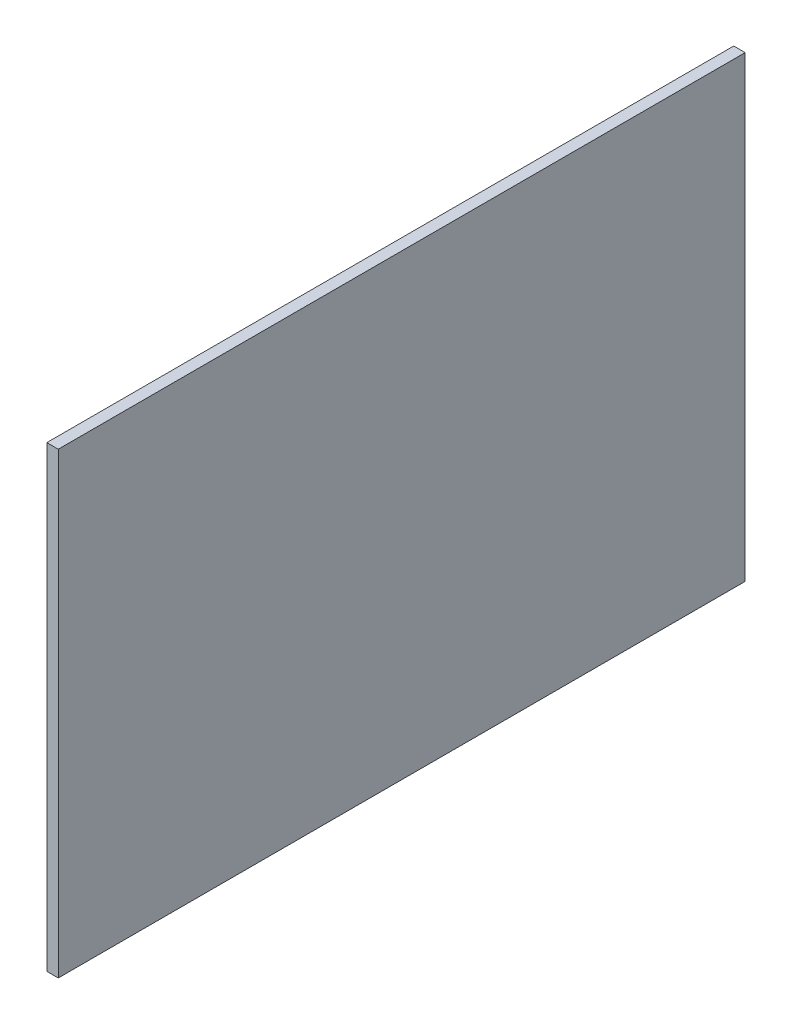
ISO-10303-21;
HEADER;
FILE_DESCRIPTION(('STEP AP214'),'2;1');
FILE_NAME('part.step','',(''),(''),'','','');
FILE_SCHEMA(('AUTOMOTIVE_DESIGN { 1 0 10303 214 1 1 1 1 }'));
ENDSEC;
DATA;
#1=APPLICATION_CONTEXT('core data for automotive mechanical design processes');
#2=APPLICATION_PROTOCOL_DEFINITION('international standard','automotive_design',2000,#1);
#3=PRODUCT_CONTEXT('',#1,'mechanical');
#4=PRODUCT('Part','Part','',(#3));
#5=PRODUCT_RELATED_PRODUCT_CATEGORY('part','',(#4));
#6=PRODUCT_DEFINITION_FORMATION('','',#4);
#7=PRODUCT_DEFINITION_CONTEXT('part definition',#1,'design');
#8=PRODUCT_DEFINITION('design','',#6,#7);
#9=PRODUCT_DEFINITION_SHAPE('','',#8);
#10=(LENGTH_UNIT() NAMED_UNIT(*) SI_UNIT(.MILLI.,.METRE.));
#11=(NAMED_UNIT(*) PLANE_ANGLE_UNIT() SI_UNIT($,.RADIAN.));
#12=(NAMED_UNIT(*) SI_UNIT($,.STERADIAN.) SOLID_ANGLE_UNIT());
#13=UNCERTAINTY_MEASURE_WITH_UNIT(LENGTH_MEASURE(1.E-05),#10,'distance_accuracy_value','');
#14=(GEOMETRIC_REPRESENTATION_CONTEXT(3) GLOBAL_UNCERTAINTY_ASSIGNED_CONTEXT((#13)) GLOBAL_UNIT_ASSIGNED_CONTEXT((#10,
#11,#12)) REPRESENTATION_CONTEXT('',''));
#15=CARTESIAN_POINT('',(0.,0.,0.));
#16=DIRECTION('',(0.,0.,1.));
#17=DIRECTION('',(1.,0.,0.));
#18=AXIS2_PLACEMENT_3D('',#15,#16,#17);
#19=CARTESIAN_POINT('',(-5282.43056856329,3750.57195608038,1655.68966799563));
#20=DIRECTION('',(0.,0.,-1.));
#21=DIRECTION('',(-1.,0.,0.));
#22=AXIS2_PLACEMENT_3D('',#19,#20,#21);
#23=PLANE('',#22);
#24=DIRECTION('',(0.,-1.,0.));
#25=VECTOR('',#24,1.);
#26=CARTESIAN_POINT('',(-5292.43056856329,3750.57195608038,1655.68966799563));
#27=LINE('',#26,#25);
#28=CARTESIAN_POINT('',(-5292.43056856329,3750.57195608038,1655.68966799563));
#29=VERTEX_POINT('',#28);
#30=CARTESIAN_POINT('',(-5292.43056856329,3350.57195608038,1655.68966799563));
#31=VERTEX_POINT('',#30);
#32=EDGE_CURVE('E113',#29,#31,#27,.T.);
#33=ORIENTED_EDGE('',*,*,#32,.T.);
#34=DIRECTION('',(-1.,0.,0.));
#35=VECTOR('',#34,1.);
#36=CARTESIAN_POINT('',(-5282.43056856329,3350.57195608038,1655.68966799563));
#37=LINE('',#36,#35);
#38=CARTESIAN_POINT('',(-5282.43056856329,3350.57195608038,1655.68966799563));
#39=VERTEX_POINT('',#38);
#40=EDGE_CURVE('E11',#39,#31,#37,.T.);
#41=ORIENTED_EDGE('',*,*,#40,.F.);
#42=DIRECTION('',(0.,-1.,0.));
#43=VECTOR('',#42,1.);
#44=CARTESIAN_POINT('',(-5282.43056856329,3750.57195608038,1655.68966799563));
#45=LINE('',#44,#43);
#46=CARTESIAN_POINT('',(-5282.43056856329,3750.57195608038,1655.68966799563));
#47=VERTEX_POINT('',#46);
#48=EDGE_CURVE('E97',#47,#39,#45,.T.);
#49=ORIENTED_EDGE('',*,*,#48,.F.);
#50=DIRECTION('',(-1.,0.,0.));
#51=VECTOR('',#50,1.);
#52=CARTESIAN_POINT('',(-5282.43056856329,3750.57195608038,1655.68966799563));
#53=LINE('',#52,#51);
#54=EDGE_CURVE('E109',#47,#29,#53,.T.);
#55=ORIENTED_EDGE('',*,*,#54,.T.);
#56=EDGE_LOOP('',(#33,#41,#49,#55));
#57=FACE_BOUND('',#56,.T.);
#58=ADVANCED_FACE('F45',(#57),#23,.F.);
#59=CARTESIAN_POINT('',(-5282.43056856329,3350.57195608038,1655.68966799563));
#60=DIRECTION('',(0.,1.,0.));
#61=DIRECTION('',(0.,0.,1.));
#62=AXIS2_PLACEMENT_3D('',#59,#60,#61);
#63=PLANE('',#62);
#64=DIRECTION('',(0.,0.,-1.));
#65=VECTOR('',#64,1.);
#66=CARTESIAN_POINT('',(-5292.43056856329,3350.57195608038,1655.68966799563));
#67=LINE('',#66,#65);
#68=CARTESIAN_POINT('',(-5292.43056856329,3350.57195608038,1055.68966799563));
#69=VERTEX_POINT('',#68);
#70=EDGE_CURVE('E102',#31,#69,#67,.T.);
#71=ORIENTED_EDGE('',*,*,#70,.T.);
#72=DIRECTION('',(-1.,0.,0.));
#73=VECTOR('',#72,1.);
#74=CARTESIAN_POINT('',(-5282.43056856329,3350.57195608038,1055.68966799563));
#75=LINE('',#74,#73);
#76=CARTESIAN_POINT('',(-5282.43056856329,3350.57195608038,1055.68966799563));
#77=VERTEX_POINT('',#76);
#78=EDGE_CURVE('E54',#77,#69,#75,.T.);
#79=ORIENTED_EDGE('',*,*,#78,.F.);
#80=DIRECTION('',(0.,0.,-1.));
#81=VECTOR('',#80,1.);
#82=CARTESIAN_POINT('',(-5282.43056856329,3350.57195608038,1655.68966799563));
#83=LINE('',#82,#81);
#84=EDGE_CURVE('E92',#39,#77,#83,.T.);
#85=ORIENTED_EDGE('',*,*,#84,.F.);
#86=ORIENTED_EDGE('',*,*,#40,.T.);
#87=EDGE_LOOP('',(#71,#79,#85,#86));
#88=FACE_BOUND('',#87,.T.);
#89=ADVANCED_FACE('F101',(#88),#63,.F.);
#90=CARTESIAN_POINT('',(-5282.43056856329,3750.57195608038,1055.68966799563));
#91=DIRECTION('',(0.,0.,1.));
#92=DIRECTION('',(1.,0.,0.));
#93=AXIS2_PLACEMENT_3D('',#90,#91,#92);
#94=PLANE('',#93);
#95=DIRECTION('',(0.,1.,0.));
#96=VECTOR('',#95,1.);
#97=CARTESIAN_POINT('',(-5292.43056856329,3750.57195608038,1055.68966799563));
#98=LINE('',#97,#96);
#99=CARTESIAN_POINT('',(-5292.43056856329,3750.57195608038,1055.68966799563));
#100=VERTEX_POINT('',#99);
#101=EDGE_CURVE('E79',#69,#100,#98,.T.);
#102=ORIENTED_EDGE('',*,*,#101,.T.);
#103=DIRECTION('',(-1.,0.,0.));
#104=VECTOR('',#103,1.);
#105=CARTESIAN_POINT('',(-5282.43056856329,3750.57195608038,1055.68966799563));
#106=LINE('',#105,#104);
#107=CARTESIAN_POINT('',(-5282.43056856329,3750.57195608038,1055.68966799563));
#108=VERTEX_POINT('',#107);
#109=EDGE_CURVE('E104',#108,#100,#106,.T.);
#110=ORIENTED_EDGE('',*,*,#109,.F.);
#111=DIRECTION('',(0.,1.,0.));
#112=VECTOR('',#111,1.);
#113=CARTESIAN_POINT('',(-5282.43056856329,3750.57195608038,1055.68966799563));
#114=LINE('',#113,#112);
#115=EDGE_CURVE('E95',#77,#108,#114,.T.);
#116=ORIENTED_EDGE('',*,*,#115,.F.);
#117=ORIENTED_EDGE('',*,*,#78,.T.);
#118=EDGE_LOOP('',(#102,#110,#116,#117));
#119=FACE_BOUND('',#118,.T.);
#120=ADVANCED_FACE('F105',(#119),#94,.F.);
#121=CARTESIAN_POINT('',(-5282.43056856329,3750.57195608038,1055.68966799563));
#122=DIRECTION('',(0.,-1.,0.));
#123=DIRECTION('',(0.,0.,-1.));
#124=AXIS2_PLACEMENT_3D('',#121,#122,#123);
#125=PLANE('',#124);
#126=DIRECTION('',(0.,0.,1.));
#127=VECTOR('',#126,1.);
#128=CARTESIAN_POINT('',(-5292.43056856329,3750.57195608038,1055.68966799563));
#129=LINE('',#128,#127);
#130=EDGE_CURVE('E85',#100,#29,#129,.T.);
#131=ORIENTED_EDGE('',*,*,#130,.T.);
#132=ORIENTED_EDGE('',*,*,#54,.F.);
#133=DIRECTION('',(0.,0.,1.));
#134=VECTOR('',#133,1.);
#135=CARTESIAN_POINT('',(-5282.43056856329,3750.57195608038,1055.68966799563));
#136=LINE('',#135,#134);
#137=EDGE_CURVE('E62',#108,#47,#136,.T.);
#138=ORIENTED_EDGE('',*,*,#137,.F.);
#139=ORIENTED_EDGE('',*,*,#109,.T.);
#140=EDGE_LOOP('',(#131,#132,#138,#139));
#141=FACE_BOUND('',#140,.T.);
#142=ADVANCED_FACE('F126',(#141),#125,.F.);
#143=CARTESIAN_POINT('',(-5282.43056856329,0.,0.));
#144=DIRECTION('',(1.,0.,0.));
#145=DIRECTION('',(0.,0.,-1.));
#146=AXIS2_PLACEMENT_3D('',#143,#144,#145);
#147=PLANE('',#146);
#148=ORIENTED_EDGE('',*,*,#48,.T.);
#149=ORIENTED_EDGE('',*,*,#84,.T.);
#150=ORIENTED_EDGE('',*,*,#115,.T.);
#151=ORIENTED_EDGE('',*,*,#137,.T.);
#152=EDGE_LOOP('',(#148,#149,#150,#151));
#153=FACE_BOUND('',#152,.T.);
#154=ADVANCED_FACE('F93',(#153),#147,.T.);
#155=CARTESIAN_POINT('',(-5292.43056856329,0.,0.));
#156=DIRECTION('',(1.,0.,0.));
#157=DIRECTION('',(0.,0.,-1.));
#158=AXIS2_PLACEMENT_3D('',#155,#156,#157);
#159=PLANE('',#158);
#160=ORIENTED_EDGE('',*,*,#32,.F.);
#161=ORIENTED_EDGE('',*,*,#130,.F.);
#162=ORIENTED_EDGE('',*,*,#101,.F.);
#163=ORIENTED_EDGE('',*,*,#70,.F.);
#164=EDGE_LOOP('',(#160,#161,#162,#163));
#165=FACE_BOUND('',#164,.T.);
#166=ADVANCED_FACE('F129',(#165),#159,.F.);
#167=CLOSED_SHELL('',(#58,#89,#120,#142,#154,#166));
#168=MANIFOLD_SOLID_BREP('B2',#167);
#169=ADVANCED_BREP_SHAPE_REPRESENTATION('',(#18,#168),#14);
#170=SHAPE_DEFINITION_REPRESENTATION(#9,#169);
ENDSEC;
END-ISO-10303-21;
